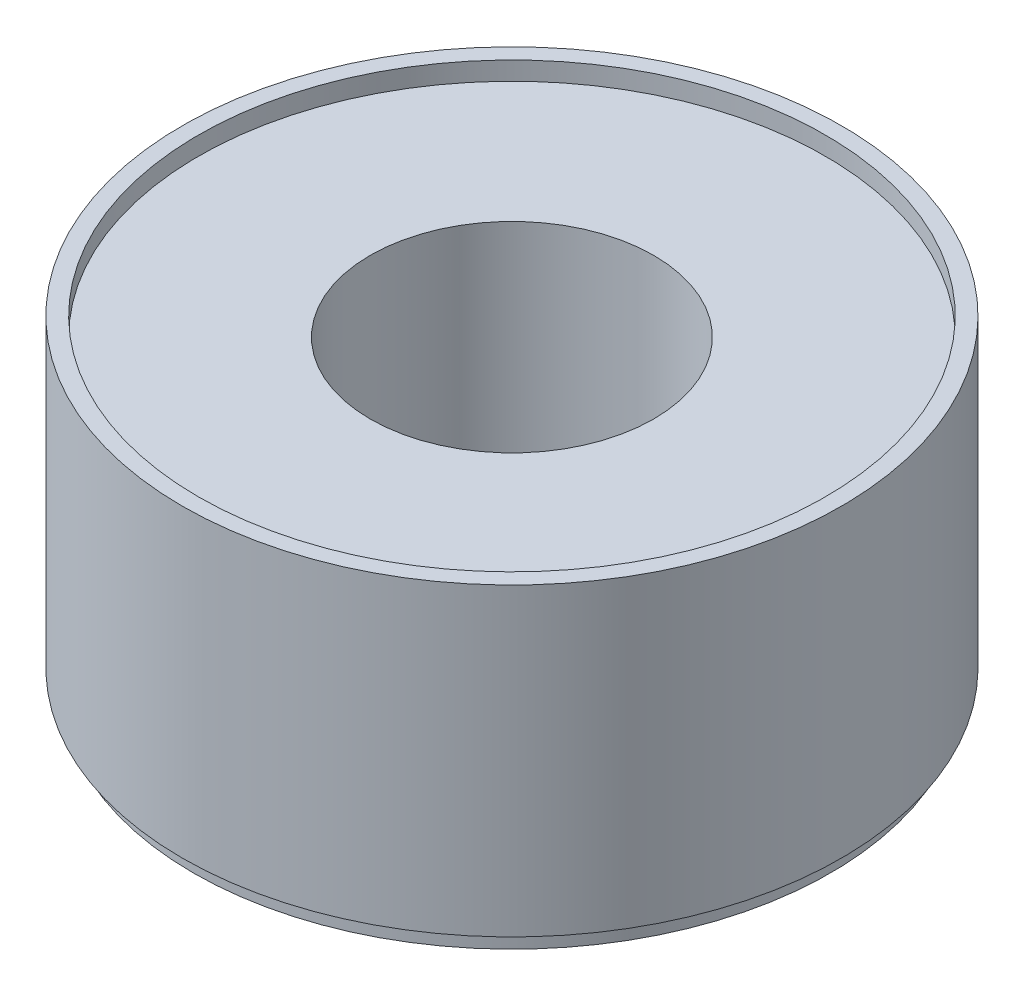
ISO-10303-21;
HEADER;
FILE_DESCRIPTION(('STEP AP214'),'2;1');
FILE_NAME('part.step','',(''),(''),'','','');
FILE_SCHEMA(('AUTOMOTIVE_DESIGN { 1 0 10303 214 1 1 1 1 }'));
ENDSEC;
DATA;
#1=APPLICATION_CONTEXT('core data for automotive mechanical design processes');
#2=APPLICATION_PROTOCOL_DEFINITION('international standard','automotive_design',2000,#1);
#3=PRODUCT_CONTEXT('',#1,'mechanical');
#4=PRODUCT('Part','Part','',(#3));
#5=PRODUCT_RELATED_PRODUCT_CATEGORY('part','',(#4));
#6=PRODUCT_DEFINITION_FORMATION('','',#4);
#7=PRODUCT_DEFINITION_CONTEXT('part definition',#1,'design');
#8=PRODUCT_DEFINITION('design','',#6,#7);
#9=PRODUCT_DEFINITION_SHAPE('','',#8);
#10=(LENGTH_UNIT() NAMED_UNIT(*) SI_UNIT(.MILLI.,.METRE.));
#11=(NAMED_UNIT(*) PLANE_ANGLE_UNIT() SI_UNIT($,.RADIAN.));
#12=(NAMED_UNIT(*) SI_UNIT($,.STERADIAN.) SOLID_ANGLE_UNIT());
#13=UNCERTAINTY_MEASURE_WITH_UNIT(LENGTH_MEASURE(1.E-05),#10,'distance_accuracy_value','');
#14=(GEOMETRIC_REPRESENTATION_CONTEXT(3) GLOBAL_UNCERTAINTY_ASSIGNED_CONTEXT((#13)) GLOBAL_UNIT_ASSIGNED_CONTEXT((#10,
#11,#12)) REPRESENTATION_CONTEXT('',''));
#15=CARTESIAN_POINT('',(0.,0.,0.));
#16=DIRECTION('',(0.,0.,1.));
#17=DIRECTION('',(1.,0.,0.));
#18=AXIS2_PLACEMENT_3D('',#15,#16,#17);
#19=CARTESIAN_POINT('',(0.,73.2832447715542,0.));
#20=DIRECTION('',(0.,1.,0.));
#21=DIRECTION('',(0.,0.,1.));
#22=AXIS2_PLACEMENT_3D('',#19,#20,#21);
#23=PLANE('',#22);
#24=CARTESIAN_POINT('',(0.,73.2832447715542,0.));
#25=DIRECTION('',(0.,1.,0.));
#26=DIRECTION('',(0.,0.,1.));
#27=AXIS2_PLACEMENT_3D('',#24,#25,#26);
#28=CIRCLE('',#27,163.522218741992);
#29=CARTESIAN_POINT('',(0.,73.2832447715542,163.522218741992));
#30=VERTEX_POINT('',#29);
#31=EDGE_CURVE('E61',#30,#30,#28,.T.);
#32=ORIENTED_EDGE('',*,*,#31,.T.);
#33=EDGE_LOOP('',(#32));
#34=FACE_BOUND('',#33,.T.);
#35=CARTESIAN_POINT('',(0.,73.2832447715542,0.));
#36=DIRECTION('',(0.,1.,0.));
#37=DIRECTION('',(0.,0.,1.));
#38=AXIS2_PLACEMENT_3D('',#35,#36,#37);
#39=CIRCLE('',#38,73.9571855690651);
#40=CARTESIAN_POINT('',(0.,73.2832447715542,73.9571855690651));
#41=VERTEX_POINT('',#40);
#42=EDGE_CURVE('E10',#41,#41,#39,.T.);
#43=ORIENTED_EDGE('',*,*,#42,.F.);
#44=EDGE_LOOP('',(#43));
#45=FACE_BOUND('',#44,.T.);
#46=ADVANCED_FACE('F33',(#34,#45),#23,.T.);
#47=CARTESIAN_POINT('',(0.,73.2368233719639,0.));
#48=DIRECTION('',(0.,1.,0.));
#49=DIRECTION('',(0.,0.,1.));
#50=AXIS2_PLACEMENT_3D('',#47,#48,#49);
#51=CYLINDRICAL_SURFACE('',#50,73.9571855690651);
#52=CARTESIAN_POINT('',(0.,-85.7231014550528,0.));
#53=DIRECTION('',(0.,1.,0.));
#54=DIRECTION('',(0.,0.,1.));
#55=AXIS2_PLACEMENT_3D('',#52,#53,#54);
#56=CIRCLE('',#55,73.9571855690652);
#57=CARTESIAN_POINT('',(0.,-85.7231014550528,73.9571855690652));
#58=VERTEX_POINT('',#57);
#59=EDGE_CURVE('E39',#58,#58,#56,.T.);
#60=ORIENTED_EDGE('',*,*,#59,.F.);
#61=EDGE_LOOP('',(#60));
#62=FACE_BOUND('',#61,.T.);
#63=ORIENTED_EDGE('',*,*,#42,.T.);
#64=EDGE_LOOP('',(#63));
#65=FACE_BOUND('',#64,.T.);
#66=ADVANCED_FACE('F99',(#62,#65),#51,.F.);
#67=CARTESIAN_POINT('',(0.,-85.7231014550528,0.));
#68=DIRECTION('',(0.,1.,0.));
#69=DIRECTION('',(0.,0.,1.));
#70=AXIS2_PLACEMENT_3D('',#67,#68,#69);
#71=PLANE('',#70);
#72=CARTESIAN_POINT('',(0.,-85.7231014550528,0.));
#73=DIRECTION('',(0.,1.,0.));
#74=DIRECTION('',(0.,0.,1.));
#75=AXIS2_PLACEMENT_3D('',#72,#73,#74);
#76=CIRCLE('',#75,166.16354679803);
#77=CARTESIAN_POINT('',(0.,-85.7231014550528,166.16354679803));
#78=VERTEX_POINT('',#77);
#79=EDGE_CURVE('E43',#78,#78,#76,.T.);
#80=ORIENTED_EDGE('',*,*,#79,.F.);
#81=EDGE_LOOP('',(#80));
#82=FACE_BOUND('',#81,.T.);
#83=ORIENTED_EDGE('',*,*,#59,.T.);
#84=EDGE_LOOP('',(#83));
#85=FACE_BOUND('',#84,.T.);
#86=ADVANCED_FACE('F94',(#82,#85),#71,.F.);
#87=CARTESIAN_POINT('',(0.,73.2368233719639,0.));
#88=DIRECTION('',(0.,1.,0.));
#89=DIRECTION('',(0.,0.,1.));
#90=AXIS2_PLACEMENT_3D('',#87,#88,#89);
#91=CYLINDRICAL_SURFACE('',#90,166.16354679803);
#92=CARTESIAN_POINT('',(0.,-76.118272160369,0.));
#93=DIRECTION('',(0.,1.,0.));
#94=DIRECTION('',(0.,0.,1.));
#95=AXIS2_PLACEMENT_3D('',#92,#93,#94);
#96=CIRCLE('',#95,166.16354679803);
#97=CARTESIAN_POINT('',(0.,-76.118272160369,166.16354679803));
#98=VERTEX_POINT('',#97);
#99=EDGE_CURVE('E47',#98,#98,#96,.T.);
#100=ORIENTED_EDGE('',*,*,#99,.F.);
#101=EDGE_LOOP('',(#100));
#102=FACE_BOUND('',#101,.T.);
#103=ORIENTED_EDGE('',*,*,#79,.T.);
#104=EDGE_LOOP('',(#103));
#105=FACE_BOUND('',#104,.T.);
#106=ADVANCED_FACE('F88',(#102,#105),#91,.T.);
#107=CARTESIAN_POINT('',(0.,-76.118272160369,0.));
#108=DIRECTION('',(0.,1.,0.));
#109=DIRECTION('',(0.,0.,1.));
#110=AXIS2_PLACEMENT_3D('',#107,#108,#109);
#111=PLANE('',#110);
#112=CARTESIAN_POINT('',(0.,-76.118272160369,0.));
#113=DIRECTION('',(0.,1.,0.));
#114=DIRECTION('',(0.,0.,1.));
#115=AXIS2_PLACEMENT_3D('',#112,#113,#114);
#116=CIRCLE('',#115,171.92644437484);
#117=CARTESIAN_POINT('',(0.,-76.118272160369,171.92644437484));
#118=VERTEX_POINT('',#117);
#119=EDGE_CURVE('E52',#118,#118,#116,.T.);
#120=ORIENTED_EDGE('',*,*,#119,.F.);
#121=EDGE_LOOP('',(#120));
#122=FACE_BOUND('',#121,.T.);
#123=ORIENTED_EDGE('',*,*,#99,.T.);
#124=EDGE_LOOP('',(#123));
#125=FACE_BOUND('',#124,.T.);
#126=ADVANCED_FACE('F82',(#122,#125),#111,.F.);
#127=CARTESIAN_POINT('',(0.,73.2368233719639,0.));
#128=DIRECTION('',(0.,1.,0.));
#129=DIRECTION('',(0.,0.,1.));
#130=AXIS2_PLACEMENT_3D('',#127,#128,#129);
#131=CYLINDRICAL_SURFACE('',#130,171.92644437484);
#132=CARTESIAN_POINT('',(0.,82.888074066238,0.));
#133=DIRECTION('',(0.,1.,0.));
#134=DIRECTION('',(0.,0.,1.));
#135=AXIS2_PLACEMENT_3D('',#132,#133,#134);
#136=CIRCLE('',#135,171.92644437484);
#137=CARTESIAN_POINT('',(0.,82.888074066238,171.92644437484));
#138=VERTEX_POINT('',#137);
#139=EDGE_CURVE('E55',#138,#138,#136,.T.);
#140=ORIENTED_EDGE('',*,*,#139,.F.);
#141=EDGE_LOOP('',(#140));
#142=FACE_BOUND('',#141,.T.);
#143=ORIENTED_EDGE('',*,*,#119,.T.);
#144=EDGE_LOOP('',(#143));
#145=FACE_BOUND('',#144,.T.);
#146=ADVANCED_FACE('F76',(#142,#145),#131,.T.);
#147=CARTESIAN_POINT('',(0.,82.888074066238,0.));
#148=DIRECTION('',(0.,-1.,0.));
#149=DIRECTION('',(0.,0.,-1.));
#150=AXIS2_PLACEMENT_3D('',#147,#148,#149);
#151=PLANE('',#150);
#152=CARTESIAN_POINT('',(0.,82.888074066238,0.));
#153=DIRECTION('',(0.,1.,0.));
#154=DIRECTION('',(0.,0.,1.));
#155=AXIS2_PLACEMENT_3D('',#152,#153,#154);
#156=CIRCLE('',#155,163.522218741992);
#157=CARTESIAN_POINT('',(0.,82.888074066238,163.522218741992));
#158=VERTEX_POINT('',#157);
#159=EDGE_CURVE('E58',#158,#158,#156,.T.);
#160=ORIENTED_EDGE('',*,*,#159,.F.);
#161=EDGE_LOOP('',(#160));
#162=FACE_BOUND('',#161,.T.);
#163=ORIENTED_EDGE('',*,*,#139,.T.);
#164=EDGE_LOOP('',(#163));
#165=FACE_BOUND('',#164,.T.);
#166=ADVANCED_FACE('F70',(#162,#165),#151,.F.);
#167=CARTESIAN_POINT('',(0.,73.2368233719639,0.));
#168=DIRECTION('',(0.,1.,0.));
#169=DIRECTION('',(0.,0.,1.));
#170=AXIS2_PLACEMENT_3D('',#167,#168,#169);
#171=CYLINDRICAL_SURFACE('',#170,163.522218741992);
#172=ORIENTED_EDGE('',*,*,#31,.F.);
#173=EDGE_LOOP('',(#172));
#174=FACE_BOUND('',#173,.T.);
#175=ORIENTED_EDGE('',*,*,#159,.T.);
#176=EDGE_LOOP('',(#175));
#177=FACE_BOUND('',#176,.T.);
#178=ADVANCED_FACE('F67',(#174,#177),#171,.F.);
#179=CLOSED_SHELL('',(#46,#66,#86,#106,#126,#146,#166,#178));
#180=MANIFOLD_SOLID_BREP('B2',#179);
#181=ADVANCED_BREP_SHAPE_REPRESENTATION('',(#18,#180),#14);
#182=SHAPE_DEFINITION_REPRESENTATION(#9,#181);
ENDSEC;
END-ISO-10303-21;
